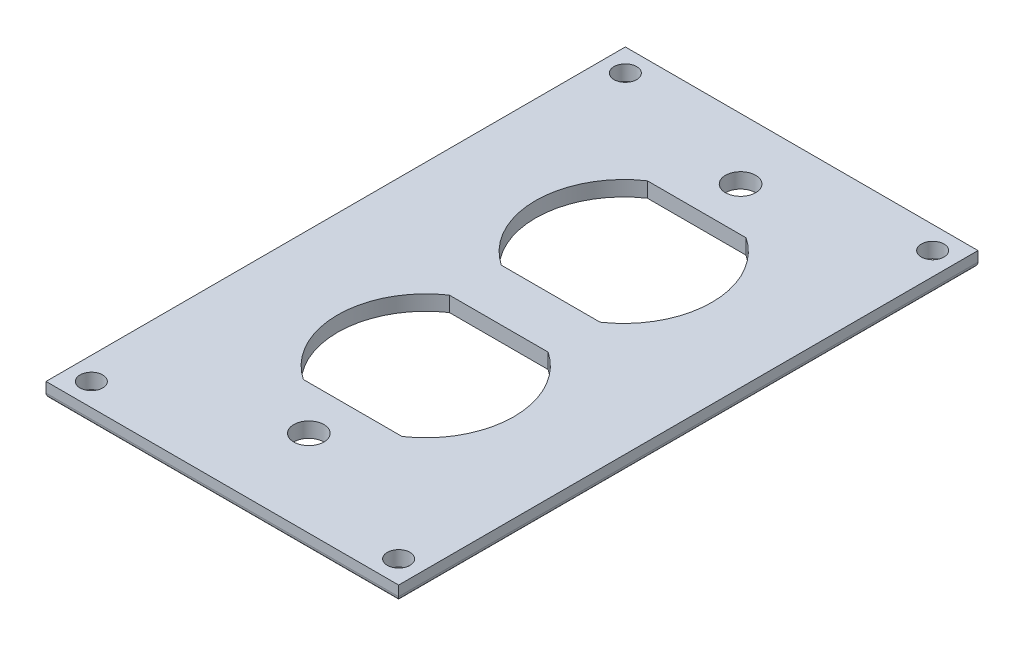
ISO-10303-21;
HEADER;
FILE_DESCRIPTION(('STEP AP214'),'2;1');
FILE_NAME('part.step','',(''),(''),'','','');
FILE_SCHEMA(('AUTOMOTIVE_DESIGN { 1 0 10303 214 1 1 1 1 }'));
ENDSEC;
DATA;
#1=APPLICATION_CONTEXT('core data for automotive mechanical design processes');
#2=APPLICATION_PROTOCOL_DEFINITION('international standard','automotive_design',2000,#1);
#3=PRODUCT_CONTEXT('',#1,'mechanical');
#4=PRODUCT('Part','Part','',(#3));
#5=PRODUCT_RELATED_PRODUCT_CATEGORY('part','',(#4));
#6=PRODUCT_DEFINITION_FORMATION('','',#4);
#7=PRODUCT_DEFINITION_CONTEXT('part definition',#1,'design');
#8=PRODUCT_DEFINITION('design','',#6,#7);
#9=PRODUCT_DEFINITION_SHAPE('','',#8);
#10=(LENGTH_UNIT() NAMED_UNIT(*) SI_UNIT(.MILLI.,.METRE.));
#11=(NAMED_UNIT(*) PLANE_ANGLE_UNIT() SI_UNIT($,.RADIAN.));
#12=(NAMED_UNIT(*) SI_UNIT($,.STERADIAN.) SOLID_ANGLE_UNIT());
#13=UNCERTAINTY_MEASURE_WITH_UNIT(LENGTH_MEASURE(1.E-05),#10,'distance_accuracy_value','');
#14=(GEOMETRIC_REPRESENTATION_CONTEXT(3) GLOBAL_UNCERTAINTY_ASSIGNED_CONTEXT((#13)) GLOBAL_UNIT_ASSIGNED_CONTEXT((#10,
#11,#12)) REPRESENTATION_CONTEXT('',''));
#15=CARTESIAN_POINT('',(0.,0.,0.));
#16=DIRECTION('',(0.,0.,1.));
#17=DIRECTION('',(1.,0.,0.));
#18=AXIS2_PLACEMENT_3D('',#15,#16,#17);
#19=CARTESIAN_POINT('',(0.,3.,0.));
#20=DIRECTION('',(0.,1.,0.));
#21=DIRECTION('',(0.,0.,1.));
#22=AXIS2_PLACEMENT_3D('',#19,#20,#21);
#23=PLANE('',#22);
#24=CARTESIAN_POINT('',(0.,3.,-45.375));
#25=DIRECTION('',(0.,1.,0.));
#26=DIRECTION('',(0.,0.,1.));
#27=AXIS2_PLACEMENT_3D('',#24,#25,#26);
#28=CIRCLE('',#27,3.);
#29=CARTESIAN_POINT('',(0.,3.,-42.375));
#30=VERTEX_POINT('',#29);
#31=EDGE_CURVE('E284',#30,#30,#28,.T.);
#32=ORIENTED_EDGE('',*,*,#31,.F.);
#33=EDGE_LOOP('',(#32));
#34=FACE_BOUND('',#33,.T.);
#35=CARTESIAN_POINT('',(0.,3.,40.325));
#36=DIRECTION('',(0.,1.,0.));
#37=DIRECTION('',(0.,0.,1.));
#38=AXIS2_PLACEMENT_3D('',#35,#36,#37);
#39=CIRCLE('',#38,3.);
#40=CARTESIAN_POINT('',(0.,3.,43.325));
#41=VERTEX_POINT('',#40);
#42=EDGE_CURVE('E281',#41,#41,#39,.T.);
#43=ORIENTED_EDGE('',*,*,#42,.F.);
#44=EDGE_LOOP('',(#43));
#45=FACE_BOUND('',#44,.T.);
#46=CARTESIAN_POINT('',(0.,3.,17.125));
#47=DIRECTION('',(0.,-1.,0.));
#48=DIRECTION('',(0.,0.,-1.));
#49=AXIS2_PLACEMENT_3D('',#46,#47,#48);
#50=CIRCLE('',#49,17.5);
#51=CARTESIAN_POINT('',(9.79795897113272,3.,2.62500000000001));
#52=VERTEX_POINT('',#51);
#53=CARTESIAN_POINT('',(9.7979589711327,3.,31.625));
#54=VERTEX_POINT('',#53);
#55=EDGE_CURVE('E251',#52,#54,#50,.T.);
#56=ORIENTED_EDGE('',*,*,#55,.T.);
#57=DIRECTION('',(1.,0.,0.));
#58=VECTOR('',#57,1.);
#59=CARTESIAN_POINT('',(0.,3.,31.625));
#60=LINE('',#59,#58);
#61=CARTESIAN_POINT('',(-9.79795897113269,3.,31.625));
#62=VERTEX_POINT('',#61);
#63=EDGE_CURVE('E161',#62,#54,#60,.T.);
#64=ORIENTED_EDGE('',*,*,#63,.F.);
#65=CARTESIAN_POINT('',(0.,3.,17.125));
#66=DIRECTION('',(0.,-1.,0.));
#67=DIRECTION('',(0.,0.,-1.));
#68=AXIS2_PLACEMENT_3D('',#65,#66,#67);
#69=CIRCLE('',#68,17.5);
#70=CARTESIAN_POINT('',(-9.79795897113271,3.,2.625));
#71=VERTEX_POINT('',#70);
#72=EDGE_CURVE('E256',#62,#71,#69,.T.);
#73=ORIENTED_EDGE('',*,*,#72,.T.);
#74=DIRECTION('',(1.,0.,0.));
#75=VECTOR('',#74,1.);
#76=CARTESIAN_POINT('',(0.,3.,2.62500000000001));
#77=LINE('',#76,#75);
#78=EDGE_CURVE('E253',#71,#52,#77,.T.);
#79=ORIENTED_EDGE('',*,*,#78,.T.);
#80=EDGE_LOOP('',(#56,#64,#73,#79));
#81=FACE_BOUND('',#80,.T.);
#82=DIRECTION('',(0.,0.,-1.));
#83=VECTOR('',#82,1.);
#84=CARTESIAN_POINT('',(35.,3.,-57.5));
#85=LINE('',#84,#83);
#86=CARTESIAN_POINT('',(35.,3.,57.5));
#87=VERTEX_POINT('',#86);
#88=CARTESIAN_POINT('',(35.,3.,-57.5));
#89=VERTEX_POINT('',#88);
#90=EDGE_CURVE('E220',#87,#89,#85,.T.);
#91=ORIENTED_EDGE('',*,*,#90,.T.);
#92=DIRECTION('',(-1.,0.,0.));
#93=VECTOR('',#92,1.);
#94=CARTESIAN_POINT('',(-35.,3.,-57.5));
#95=LINE('',#94,#93);
#96=CARTESIAN_POINT('',(-35.,3.,-57.5));
#97=VERTEX_POINT('',#96);
#98=EDGE_CURVE('E218',#89,#97,#95,.T.);
#99=ORIENTED_EDGE('',*,*,#98,.T.);
#100=DIRECTION('',(0.,0.,1.));
#101=VECTOR('',#100,1.);
#102=CARTESIAN_POINT('',(-35.,3.,-57.5));
#103=LINE('',#102,#101);
#104=CARTESIAN_POINT('',(-35.,3.,57.5));
#105=VERTEX_POINT('',#104);
#106=EDGE_CURVE('E216',#97,#105,#103,.T.);
#107=ORIENTED_EDGE('',*,*,#106,.T.);
#108=DIRECTION('',(1.,0.,0.));
#109=VECTOR('',#108,1.);
#110=CARTESIAN_POINT('',(-35.,3.,57.5));
#111=LINE('',#110,#109);
#112=EDGE_CURVE('E214',#105,#87,#111,.T.);
#113=ORIENTED_EDGE('',*,*,#112,.T.);
#114=EDGE_LOOP('',(#91,#99,#107,#113));
#115=FACE_BOUND('',#114,.T.);
#116=CARTESIAN_POINT('',(-30.5,3.,53.));
#117=DIRECTION('',(0.,-1.,0.));
#118=DIRECTION('',(0.,0.,-1.));
#119=AXIS2_PLACEMENT_3D('',#116,#117,#118);
#120=CIRCLE('',#119,2.25000000000001);
#121=CARTESIAN_POINT('',(-30.5,3.,50.75));
#122=VERTEX_POINT('',#121);
#123=EDGE_CURVE('E223',#122,#122,#120,.T.);
#124=ORIENTED_EDGE('',*,*,#123,.T.);
#125=EDGE_LOOP('',(#124));
#126=FACE_BOUND('',#125,.T.);
#127=CARTESIAN_POINT('',(-30.5,3.,-53.));
#128=DIRECTION('',(0.,1.,0.));
#129=DIRECTION('',(0.,0.,1.));
#130=AXIS2_PLACEMENT_3D('',#127,#128,#129);
#131=CIRCLE('',#130,2.25000000000001);
#132=CARTESIAN_POINT('',(-30.5,3.,-50.75));
#133=VERTEX_POINT('',#132);
#134=EDGE_CURVE('E227',#133,#133,#131,.T.);
#135=ORIENTED_EDGE('',*,*,#134,.F.);
#136=EDGE_LOOP('',(#135));
#137=FACE_BOUND('',#136,.T.);
#138=CARTESIAN_POINT('',(30.5,3.,53.));
#139=DIRECTION('',(0.,1.,0.));
#140=DIRECTION('',(0.,0.,-1.));
#141=AXIS2_PLACEMENT_3D('',#138,#139,#140);
#142=CIRCLE('',#141,2.25000000000001);
#143=CARTESIAN_POINT('',(30.5,3.,50.75));
#144=VERTEX_POINT('',#143);
#145=EDGE_CURVE('E233',#144,#144,#142,.T.);
#146=ORIENTED_EDGE('',*,*,#145,.F.);
#147=EDGE_LOOP('',(#146));
#148=FACE_BOUND('',#147,.T.);
#149=CARTESIAN_POINT('',(30.5,3.,-53.));
#150=DIRECTION('',(0.,-1.,0.));
#151=DIRECTION('',(0.,0.,1.));
#152=AXIS2_PLACEMENT_3D('',#149,#150,#151);
#153=CIRCLE('',#152,2.25000000000001);
#154=CARTESIAN_POINT('',(30.5,3.,-50.75));
#155=VERTEX_POINT('',#154);
#156=EDGE_CURVE('E239',#155,#155,#153,.T.);
#157=ORIENTED_EDGE('',*,*,#156,.T.);
#158=EDGE_LOOP('',(#157));
#159=FACE_BOUND('',#158,.T.);
#160=DIRECTION('',(1.,0.,0.));
#161=VECTOR('',#160,1.);
#162=CARTESIAN_POINT('',(0.,3.,-36.675));
#163=LINE('',#162,#161);
#164=CARTESIAN_POINT('',(-9.79795897113269,3.,-36.675));
#165=VERTEX_POINT('',#164);
#166=CARTESIAN_POINT('',(9.7979589711327,3.,-36.675));
#167=VERTEX_POINT('',#166);
#168=EDGE_CURVE('E274',#165,#167,#163,.T.);
#169=ORIENTED_EDGE('',*,*,#168,.T.);
#170=CARTESIAN_POINT('',(0.,3.,-22.175));
#171=DIRECTION('',(0.,1.,0.));
#172=DIRECTION('',(0.,0.,1.));
#173=AXIS2_PLACEMENT_3D('',#170,#171,#172);
#174=CIRCLE('',#173,17.5);
#175=CARTESIAN_POINT('',(9.79795897113272,3.,-7.67499999999999));
#176=VERTEX_POINT('',#175);
#177=EDGE_CURVE('E272',#176,#167,#174,.T.);
#178=ORIENTED_EDGE('',*,*,#177,.F.);
#179=DIRECTION('',(1.,0.,0.));
#180=VECTOR('',#179,1.);
#181=CARTESIAN_POINT('',(0.,3.,-7.67499999999999));
#182=LINE('',#181,#180);
#183=CARTESIAN_POINT('',(-9.79795897113271,3.,-7.67499999999999));
#184=VERTEX_POINT('',#183);
#185=EDGE_CURVE('E270',#184,#176,#182,.T.);
#186=ORIENTED_EDGE('',*,*,#185,.F.);
#187=CARTESIAN_POINT('',(0.,3.,-22.175));
#188=DIRECTION('',(0.,1.,0.));
#189=DIRECTION('',(0.,0.,1.));
#190=AXIS2_PLACEMENT_3D('',#187,#188,#189);
#191=CIRCLE('',#190,17.5);
#192=EDGE_CURVE('E266',#165,#184,#191,.T.);
#193=ORIENTED_EDGE('',*,*,#192,.F.);
#194=EDGE_LOOP('',(#169,#178,#186,#193));
#195=FACE_BOUND('',#194,.T.);
#196=ADVANCED_FACE('F39',(#34,#45,#81,#115,#126,#137,#148,#159,#195),#23,.T.);
#197=CARTESIAN_POINT('',(0.,0.,0.));
#198=DIRECTION('',(0.,1.,0.));
#199=DIRECTION('',(0.,0.,1.));
#200=AXIS2_PLACEMENT_3D('',#197,#198,#199);
#201=PLANE('',#200);
#202=CARTESIAN_POINT('',(0.,0.,-45.375));
#203=DIRECTION('',(0.,1.,0.));
#204=DIRECTION('',(0.,0.,1.));
#205=AXIS2_PLACEMENT_3D('',#202,#203,#204);
#206=CIRCLE('',#205,3.);
#207=CARTESIAN_POINT('',(0.,0.,-42.375));
#208=VERTEX_POINT('',#207);
#209=EDGE_CURVE('E277',#208,#208,#206,.T.);
#210=ORIENTED_EDGE('',*,*,#209,.T.);
#211=EDGE_LOOP('',(#210));
#212=FACE_BOUND('',#211,.T.);
#213=CARTESIAN_POINT('',(0.,0.,40.325));
#214=DIRECTION('',(0.,1.,0.));
#215=DIRECTION('',(0.,0.,1.));
#216=AXIS2_PLACEMENT_3D('',#213,#214,#215);
#217=CIRCLE('',#216,3.);
#218=CARTESIAN_POINT('',(0.,0.,43.325));
#219=VERTEX_POINT('',#218);
#220=EDGE_CURVE('E278',#219,#219,#217,.T.);
#221=ORIENTED_EDGE('',*,*,#220,.T.);
#222=EDGE_LOOP('',(#221));
#223=FACE_BOUND('',#222,.T.);
#224=CARTESIAN_POINT('',(-30.5,0.,53.));
#225=DIRECTION('',(0.,-1.,0.));
#226=DIRECTION('',(0.,0.,-1.));
#227=AXIS2_PLACEMENT_3D('',#224,#225,#226);
#228=CIRCLE('',#227,2.25000000000001);
#229=CARTESIAN_POINT('',(-30.5,0.,50.75));
#230=VERTEX_POINT('',#229);
#231=EDGE_CURVE('E224',#230,#230,#228,.T.);
#232=ORIENTED_EDGE('',*,*,#231,.F.);
#233=EDGE_LOOP('',(#232));
#234=FACE_BOUND('',#233,.T.);
#235=CARTESIAN_POINT('',(-30.5,0.,-53.));
#236=DIRECTION('',(0.,1.,0.));
#237=DIRECTION('',(0.,0.,1.));
#238=AXIS2_PLACEMENT_3D('',#235,#236,#237);
#239=CIRCLE('',#238,2.25000000000001);
#240=CARTESIAN_POINT('',(-30.5,0.,-50.75));
#241=VERTEX_POINT('',#240);
#242=EDGE_CURVE('E230',#241,#241,#239,.T.);
#243=ORIENTED_EDGE('',*,*,#242,.T.);
#244=EDGE_LOOP('',(#243));
#245=FACE_BOUND('',#244,.T.);
#246=CARTESIAN_POINT('',(30.5,0.,53.));
#247=DIRECTION('',(0.,1.,0.));
#248=DIRECTION('',(0.,0.,-1.));
#249=AXIS2_PLACEMENT_3D('',#246,#247,#248);
#250=CIRCLE('',#249,2.25000000000001);
#251=CARTESIAN_POINT('',(30.5,0.,50.75));
#252=VERTEX_POINT('',#251);
#253=EDGE_CURVE('E236',#252,#252,#250,.T.);
#254=ORIENTED_EDGE('',*,*,#253,.T.);
#255=EDGE_LOOP('',(#254));
#256=FACE_BOUND('',#255,.T.);
#257=CARTESIAN_POINT('',(30.5,0.,-53.));
#258=DIRECTION('',(0.,-1.,0.));
#259=DIRECTION('',(0.,0.,1.));
#260=AXIS2_PLACEMENT_3D('',#257,#258,#259);
#261=CIRCLE('',#260,2.25000000000001);
#262=CARTESIAN_POINT('',(30.5,0.,-50.75));
#263=VERTEX_POINT('',#262);
#264=EDGE_CURVE('E178',#263,#263,#261,.T.);
#265=ORIENTED_EDGE('',*,*,#264,.F.);
#266=EDGE_LOOP('',(#265));
#267=FACE_BOUND('',#266,.T.);
#268=DIRECTION('',(0.,0.,-1.));
#269=VECTOR('',#268,1.);
#270=CARTESIAN_POINT('',(34.,0.,0.));
#271=LINE('',#270,#269);
#272=CARTESIAN_POINT('',(34.,0.,-56.5));
#273=VERTEX_POINT('',#272);
#274=CARTESIAN_POINT('',(34.,0.,56.5));
#275=VERTEX_POINT('',#274);
#276=EDGE_CURVE('E197',#273,#275,#271,.F.);
#277=ORIENTED_EDGE('',*,*,#276,.T.);
#278=DIRECTION('',(1.,0.,0.));
#279=VECTOR('',#278,1.);
#280=CARTESIAN_POINT('',(0.,0.,56.5));
#281=LINE('',#280,#279);
#282=CARTESIAN_POINT('',(-34.,0.,56.5));
#283=VERTEX_POINT('',#282);
#284=EDGE_CURVE('E190',#275,#283,#281,.F.);
#285=ORIENTED_EDGE('',*,*,#284,.T.);
#286=DIRECTION('',(0.,0.,1.));
#287=VECTOR('',#286,1.);
#288=CARTESIAN_POINT('',(-34.,0.,0.));
#289=LINE('',#288,#287);
#290=CARTESIAN_POINT('',(-34.,0.,-56.5));
#291=VERTEX_POINT('',#290);
#292=EDGE_CURVE('E193',#283,#291,#289,.F.);
#293=ORIENTED_EDGE('',*,*,#292,.T.);
#294=DIRECTION('',(-1.,0.,0.));
#295=VECTOR('',#294,1.);
#296=CARTESIAN_POINT('',(0.,0.,-56.5));
#297=LINE('',#296,#295);
#298=EDGE_CURVE('E195',#291,#273,#297,.F.);
#299=ORIENTED_EDGE('',*,*,#298,.T.);
#300=EDGE_LOOP('',(#277,#285,#293,#299));
#301=FACE_BOUND('',#300,.T.);
#302=DIRECTION('',(-1.,0.,0.));
#303=VECTOR('',#302,1.);
#304=CARTESIAN_POINT('',(0.,0.,31.625));
#305=LINE('',#304,#303);
#306=CARTESIAN_POINT('',(9.7979589711327,0.,31.625));
#307=VERTEX_POINT('',#306);
#308=CARTESIAN_POINT('',(-9.79795897113269,0.,31.625));
#309=VERTEX_POINT('',#308);
#310=EDGE_CURVE('E155',#307,#309,#305,.T.);
#311=ORIENTED_EDGE('',*,*,#310,.F.);
#312=CARTESIAN_POINT('',(0.,0.,17.125));
#313=DIRECTION('',(0.,-1.,0.));
#314=DIRECTION('',(0.,0.,-1.));
#315=AXIS2_PLACEMENT_3D('',#312,#313,#314);
#316=CIRCLE('',#315,17.5);
#317=CARTESIAN_POINT('',(9.79795897113273,0.,2.62500000000001));
#318=VERTEX_POINT('',#317);
#319=EDGE_CURVE('E145',#307,#318,#316,.F.);
#320=ORIENTED_EDGE('',*,*,#319,.T.);
#321=DIRECTION('',(1.,0.,0.));
#322=VECTOR('',#321,1.);
#323=CARTESIAN_POINT('',(0.,0.,2.62500000000001));
#324=LINE('',#323,#322);
#325=CARTESIAN_POINT('',(-9.79795897113272,0.,2.62500000000001));
#326=VERTEX_POINT('',#325);
#327=EDGE_CURVE('E156',#318,#326,#324,.F.);
#328=ORIENTED_EDGE('',*,*,#327,.T.);
#329=CARTESIAN_POINT('',(0.,0.,17.125));
#330=DIRECTION('',(0.,-1.,0.));
#331=DIRECTION('',(0.,0.,-1.));
#332=AXIS2_PLACEMENT_3D('',#329,#330,#331);
#333=CIRCLE('',#332,17.5);
#334=EDGE_CURVE('E166',#326,#309,#333,.F.);
#335=ORIENTED_EDGE('',*,*,#334,.T.);
#336=EDGE_LOOP('',(#311,#320,#328,#335));
#337=FACE_BOUND('',#336,.T.);
#338=CARTESIAN_POINT('',(0.,0.,-22.175));
#339=DIRECTION('',(0.,-1.,0.));
#340=DIRECTION('',(0.,0.,-1.));
#341=AXIS2_PLACEMENT_3D('',#338,#339,#340);
#342=CIRCLE('',#341,17.5);
#343=CARTESIAN_POINT('',(9.7979589711327,0.,-36.675));
#344=VERTEX_POINT('',#343);
#345=CARTESIAN_POINT('',(9.79795897113273,0.,-7.675));
#346=VERTEX_POINT('',#345);
#347=EDGE_CURVE('E167',#344,#346,#342,.T.);
#348=ORIENTED_EDGE('',*,*,#347,.F.);
#349=DIRECTION('',(1.,0.,0.));
#350=VECTOR('',#349,1.);
#351=CARTESIAN_POINT('',(0.,0.,-36.675));
#352=LINE('',#351,#350);
#353=CARTESIAN_POINT('',(-9.79795897113269,0.,-36.675));
#354=VERTEX_POINT('',#353);
#355=EDGE_CURVE('E11',#344,#354,#352,.F.);
#356=ORIENTED_EDGE('',*,*,#355,.T.);
#357=CARTESIAN_POINT('',(0.,0.,-22.175));
#358=DIRECTION('',(0.,-1.,0.));
#359=DIRECTION('',(0.,0.,-1.));
#360=AXIS2_PLACEMENT_3D('',#357,#358,#359);
#361=CIRCLE('',#360,17.5);
#362=CARTESIAN_POINT('',(-9.79795897113271,0.,-7.67499999999999));
#363=VERTEX_POINT('',#362);
#364=EDGE_CURVE('E48',#363,#354,#361,.T.);
#365=ORIENTED_EDGE('',*,*,#364,.F.);
#366=DIRECTION('',(-1.,0.,0.));
#367=VECTOR('',#366,1.);
#368=CARTESIAN_POINT('',(0.,0.,-7.67499999999999));
#369=LINE('',#368,#367);
#370=EDGE_CURVE('E72',#346,#363,#369,.T.);
#371=ORIENTED_EDGE('',*,*,#370,.F.);
#372=EDGE_LOOP('',(#348,#356,#365,#371));
#373=FACE_BOUND('',#372,.T.);
#374=ADVANCED_FACE('F164',(#212,#223,#234,#245,#256,#267,#301,#337,#373),#201,.F.);
#375=CARTESIAN_POINT('',(35.,3.,-57.5));
#376=DIRECTION('',(-1.,0.,0.));
#377=DIRECTION('',(0.,0.,1.));
#378=AXIS2_PLACEMENT_3D('',#375,#376,#377);
#379=PLANE('',#378);
#380=DIRECTION('',(0.,-1.,0.));
#381=VECTOR('',#380,1.);
#382=CARTESIAN_POINT('',(35.,3.,57.5));
#383=LINE('',#382,#381);
#384=CARTESIAN_POINT('',(35.,1.,57.5));
#385=VERTEX_POINT('',#384);
#386=EDGE_CURVE('E211',#87,#385,#383,.T.);
#387=ORIENTED_EDGE('',*,*,#386,.T.);
#388=DIRECTION('',(0.,0.,-1.));
#389=VECTOR('',#388,1.);
#390=CARTESIAN_POINT('',(35.,1.,-57.5));
#391=LINE('',#390,#389);
#392=CARTESIAN_POINT('',(35.,1.,-57.5));
#393=VERTEX_POINT('',#392);
#394=EDGE_CURVE('E174',#385,#393,#391,.T.);
#395=ORIENTED_EDGE('',*,*,#394,.T.);
#396=DIRECTION('',(0.,-1.,0.));
#397=VECTOR('',#396,1.);
#398=CARTESIAN_POINT('',(35.,3.,-57.5));
#399=LINE('',#398,#397);
#400=EDGE_CURVE('E202',#89,#393,#399,.T.);
#401=ORIENTED_EDGE('',*,*,#400,.F.);
#402=ORIENTED_EDGE('',*,*,#90,.F.);
#403=EDGE_LOOP('',(#387,#395,#401,#402));
#404=FACE_BOUND('',#403,.T.);
#405=ADVANCED_FACE('F376',(#404),#379,.F.);
#406=CARTESIAN_POINT('',(-35.,3.,-57.5));
#407=DIRECTION('',(0.,0.,1.));
#408=DIRECTION('',(1.,0.,0.));
#409=AXIS2_PLACEMENT_3D('',#406,#407,#408);
#410=PLANE('',#409);
#411=ORIENTED_EDGE('',*,*,#400,.T.);
#412=DIRECTION('',(-1.,0.,0.));
#413=VECTOR('',#412,1.);
#414=CARTESIAN_POINT('',(-35.,1.,-57.5));
#415=LINE('',#414,#413);
#416=CARTESIAN_POINT('',(-35.,1.,-57.5));
#417=VERTEX_POINT('',#416);
#418=EDGE_CURVE('E186',#393,#417,#415,.T.);
#419=ORIENTED_EDGE('',*,*,#418,.T.);
#420=DIRECTION('',(0.,-1.,0.));
#421=VECTOR('',#420,1.);
#422=CARTESIAN_POINT('',(-35.,3.,-57.5));
#423=LINE('',#422,#421);
#424=EDGE_CURVE('E205',#97,#417,#423,.T.);
#425=ORIENTED_EDGE('',*,*,#424,.F.);
#426=ORIENTED_EDGE('',*,*,#98,.F.);
#427=EDGE_LOOP('',(#411,#419,#425,#426));
#428=FACE_BOUND('',#427,.T.);
#429=ADVANCED_FACE('F383',(#428),#410,.F.);
#430=CARTESIAN_POINT('',(-35.,3.,-57.5));
#431=DIRECTION('',(1.,0.,0.));
#432=DIRECTION('',(0.,0.,-1.));
#433=AXIS2_PLACEMENT_3D('',#430,#431,#432);
#434=PLANE('',#433);
#435=ORIENTED_EDGE('',*,*,#424,.T.);
#436=DIRECTION('',(0.,0.,1.));
#437=VECTOR('',#436,1.);
#438=CARTESIAN_POINT('',(-35.,1.,-57.5));
#439=LINE('',#438,#437);
#440=CARTESIAN_POINT('',(-35.,1.,57.5));
#441=VERTEX_POINT('',#440);
#442=EDGE_CURVE('E188',#417,#441,#439,.T.);
#443=ORIENTED_EDGE('',*,*,#442,.T.);
#444=DIRECTION('',(0.,-1.,0.));
#445=VECTOR('',#444,1.);
#446=CARTESIAN_POINT('',(-35.,3.,57.5));
#447=LINE('',#446,#445);
#448=EDGE_CURVE('E208',#105,#441,#447,.T.);
#449=ORIENTED_EDGE('',*,*,#448,.F.);
#450=ORIENTED_EDGE('',*,*,#106,.F.);
#451=EDGE_LOOP('',(#435,#443,#449,#450));
#452=FACE_BOUND('',#451,.T.);
#453=ADVANCED_FACE('F379',(#452),#434,.F.);
#454=CARTESIAN_POINT('',(-35.,3.,57.5));
#455=DIRECTION('',(0.,0.,-1.));
#456=DIRECTION('',(-1.,0.,0.));
#457=AXIS2_PLACEMENT_3D('',#454,#455,#456);
#458=PLANE('',#457);
#459=ORIENTED_EDGE('',*,*,#448,.T.);
#460=DIRECTION('',(1.,0.,0.));
#461=VECTOR('',#460,1.);
#462=CARTESIAN_POINT('',(-35.,1.,57.5));
#463=LINE('',#462,#461);
#464=EDGE_CURVE('E199',#441,#385,#463,.T.);
#465=ORIENTED_EDGE('',*,*,#464,.T.);
#466=ORIENTED_EDGE('',*,*,#386,.F.);
#467=ORIENTED_EDGE('',*,*,#112,.F.);
#468=EDGE_LOOP('',(#459,#465,#466,#467));
#469=FACE_BOUND('',#468,.T.);
#470=ADVANCED_FACE('F371',(#469),#458,.F.);
#471=CARTESIAN_POINT('',(-30.5,3.,53.));
#472=DIRECTION('',(0.,-1.,0.));
#473=DIRECTION('',(0.,0.,-1.));
#474=AXIS2_PLACEMENT_3D('',#471,#472,#473);
#475=CYLINDRICAL_SURFACE('',#474,2.25000000000001);
#476=ORIENTED_EDGE('',*,*,#123,.F.);
#477=EDGE_LOOP('',(#476));
#478=FACE_BOUND('',#477,.T.);
#479=ORIENTED_EDGE('',*,*,#231,.T.);
#480=EDGE_LOOP('',(#479));
#481=FACE_BOUND('',#480,.T.);
#482=ADVANCED_FACE('F368',(#478,#481),#475,.F.);
#483=CARTESIAN_POINT('',(-30.5,3.,-53.));
#484=DIRECTION('',(0.,-1.,0.));
#485=DIRECTION('',(0.,0.,-1.));
#486=AXIS2_PLACEMENT_3D('',#483,#484,#485);
#487=CYLINDRICAL_SURFACE('',#486,2.25000000000001);
#488=ORIENTED_EDGE('',*,*,#134,.T.);
#489=EDGE_LOOP('',(#488));
#490=FACE_BOUND('',#489,.T.);
#491=ORIENTED_EDGE('',*,*,#242,.F.);
#492=EDGE_LOOP('',(#491));
#493=FACE_BOUND('',#492,.T.);
#494=ADVANCED_FACE('F364',(#490,#493),#487,.F.);
#495=CARTESIAN_POINT('',(30.5,3.,53.));
#496=DIRECTION('',(0.,-1.,0.));
#497=DIRECTION('',(0.,0.,-1.));
#498=AXIS2_PLACEMENT_3D('',#495,#496,#497);
#499=CYLINDRICAL_SURFACE('',#498,2.25000000000001);
#500=ORIENTED_EDGE('',*,*,#145,.T.);
#501=EDGE_LOOP('',(#500));
#502=FACE_BOUND('',#501,.T.);
#503=ORIENTED_EDGE('',*,*,#253,.F.);
#504=EDGE_LOOP('',(#503));
#505=FACE_BOUND('',#504,.T.);
#506=ADVANCED_FACE('F360',(#502,#505),#499,.F.);
#507=CARTESIAN_POINT('',(30.5,3.,-53.));
#508=DIRECTION('',(0.,-1.,0.));
#509=DIRECTION('',(0.,0.,-1.));
#510=AXIS2_PLACEMENT_3D('',#507,#508,#509);
#511=CYLINDRICAL_SURFACE('',#510,2.25000000000001);
#512=ORIENTED_EDGE('',*,*,#156,.F.);
#513=EDGE_LOOP('',(#512));
#514=FACE_BOUND('',#513,.T.);
#515=ORIENTED_EDGE('',*,*,#264,.T.);
#516=EDGE_LOOP('',(#515));
#517=FACE_BOUND('',#516,.T.);
#518=ADVANCED_FACE('F357',(#514,#517),#511,.F.);
#519=CARTESIAN_POINT('',(-35.,1.,-56.5));
#520=DIRECTION('',(-1.,0.,0.));
#521=DIRECTION('',(0.,0.,1.));
#522=AXIS2_PLACEMENT_3D('',#519,#520,#521);
#523=CYLINDRICAL_SURFACE('',#522,1.);
#524=CARTESIAN_POINT('',(34.,1.,-56.5));
#525=DIRECTION('',(-0.707106781186547,0.,-0.707106781186547));
#526=DIRECTION('',(0.707106781186547,0.,-0.707106781186548));
#527=AXIS2_PLACEMENT_3D('',#524,#525,#526);
#528=ELLIPSE('',#527,1.41421356237309,1.);
#529=EDGE_CURVE('E179',#273,#393,#528,.F.);
#530=ORIENTED_EDGE('',*,*,#529,.F.);
#531=ORIENTED_EDGE('',*,*,#298,.F.);
#532=CARTESIAN_POINT('',(-34.,1.,-56.5));
#533=DIRECTION('',(-0.707106781186547,0.,0.707106781186548));
#534=DIRECTION('',(-0.707106781186548,0.,-0.707106781186547));
#535=AXIS2_PLACEMENT_3D('',#532,#533,#534);
#536=ELLIPSE('',#535,1.4142135623731,1.);
#537=EDGE_CURVE('E175',#417,#291,#536,.T.);
#538=ORIENTED_EDGE('',*,*,#537,.F.);
#539=ORIENTED_EDGE('',*,*,#418,.F.);
#540=EDGE_LOOP('',(#530,#531,#538,#539));
#541=FACE_BOUND('',#540,.T.);
#542=ADVANCED_FACE('F41',(#541),#523,.T.);
#543=CARTESIAN_POINT('',(-34.,1.,-57.5));
#544=DIRECTION('',(0.,0.,1.));
#545=DIRECTION('',(1.,0.,0.));
#546=AXIS2_PLACEMENT_3D('',#543,#544,#545);
#547=CYLINDRICAL_SURFACE('',#546,1.);
#548=ORIENTED_EDGE('',*,*,#537,.T.);
#549=ORIENTED_EDGE('',*,*,#292,.F.);
#550=CARTESIAN_POINT('',(-34.,1.,56.5));
#551=DIRECTION('',(0.707106781186548,0.,0.707106781186547));
#552=DIRECTION('',(-0.707106781186547,0.,0.707106781186548));
#553=AXIS2_PLACEMENT_3D('',#550,#551,#552);
#554=ELLIPSE('',#553,1.41421356237309,1.);
#555=EDGE_CURVE('E182',#441,#283,#554,.T.);
#556=ORIENTED_EDGE('',*,*,#555,.F.);
#557=ORIENTED_EDGE('',*,*,#442,.F.);
#558=EDGE_LOOP('',(#548,#549,#556,#557));
#559=FACE_BOUND('',#558,.T.);
#560=ADVANCED_FACE('F396',(#559),#547,.T.);
#561=CARTESIAN_POINT('',(34.,1.,-57.5));
#562=DIRECTION('',(0.,0.,-1.));
#563=DIRECTION('',(-1.,0.,0.));
#564=AXIS2_PLACEMENT_3D('',#561,#562,#563);
#565=CYLINDRICAL_SURFACE('',#564,1.);
#566=ORIENTED_EDGE('',*,*,#529,.T.);
#567=ORIENTED_EDGE('',*,*,#394,.F.);
#568=CARTESIAN_POINT('',(34.,1.,56.5));
#569=DIRECTION('',(0.707106781186547,0.,-0.707106781186548));
#570=DIRECTION('',(-0.707106781186547,0.,-0.707106781186547));
#571=AXIS2_PLACEMENT_3D('',#568,#569,#570);
#572=ELLIPSE('',#571,1.4142135623731,1.);
#573=EDGE_CURVE('E162',#275,#385,#572,.F.);
#574=ORIENTED_EDGE('',*,*,#573,.F.);
#575=ORIENTED_EDGE('',*,*,#276,.F.);
#576=EDGE_LOOP('',(#566,#567,#574,#575));
#577=FACE_BOUND('',#576,.T.);
#578=ADVANCED_FACE('F393',(#577),#565,.T.);
#579=CARTESIAN_POINT('',(-35.,1.,56.5));
#580=DIRECTION('',(1.,0.,0.));
#581=DIRECTION('',(0.,0.,-1.));
#582=AXIS2_PLACEMENT_3D('',#579,#580,#581);
#583=CYLINDRICAL_SURFACE('',#582,1.);
#584=ORIENTED_EDGE('',*,*,#555,.T.);
#585=ORIENTED_EDGE('',*,*,#284,.F.);
#586=ORIENTED_EDGE('',*,*,#573,.T.);
#587=ORIENTED_EDGE('',*,*,#464,.F.);
#588=EDGE_LOOP('',(#584,#585,#586,#587));
#589=FACE_BOUND('',#588,.T.);
#590=ADVANCED_FACE('F356',(#589),#583,.T.);
#591=CARTESIAN_POINT('',(0.,3.,31.625));
#592=DIRECTION('',(0.,0.,-1.));
#593=DIRECTION('',(-1.,0.,0.));
#594=AXIS2_PLACEMENT_3D('',#591,#592,#593);
#595=PLANE('',#594);
#596=ORIENTED_EDGE('',*,*,#310,.T.);
#597=DIRECTION('',(0.,-1.,0.));
#598=VECTOR('',#597,1.);
#599=CARTESIAN_POINT('',(-9.79795897113269,3.,31.625));
#600=LINE('',#599,#598);
#601=EDGE_CURVE('E87',#62,#309,#600,.T.);
#602=ORIENTED_EDGE('',*,*,#601,.F.);
#603=ORIENTED_EDGE('',*,*,#63,.T.);
#604=DIRECTION('',(0.,-1.,0.));
#605=VECTOR('',#604,1.);
#606=CARTESIAN_POINT('',(9.7979589711327,3.,31.625));
#607=LINE('',#606,#605);
#608=EDGE_CURVE('E149',#54,#307,#607,.T.);
#609=ORIENTED_EDGE('',*,*,#608,.T.);
#610=EDGE_LOOP('',(#596,#602,#603,#609));
#611=FACE_BOUND('',#610,.T.);
#612=ADVANCED_FACE('F158',(#611),#595,.T.);
#613=CARTESIAN_POINT('',(0.,3.,17.125));
#614=DIRECTION('',(0.,-1.,0.));
#615=DIRECTION('',(0.,0.,-1.));
#616=AXIS2_PLACEMENT_3D('',#613,#614,#615);
#617=CYLINDRICAL_SURFACE('',#616,17.5);
#618=ORIENTED_EDGE('',*,*,#608,.F.);
#619=ORIENTED_EDGE('',*,*,#55,.F.);
#620=DIRECTION('',(0.,-1.,0.));
#621=VECTOR('',#620,1.);
#622=CARTESIAN_POINT('',(9.79795897113272,3.,2.62500000000001));
#623=LINE('',#622,#621);
#624=EDGE_CURVE('E151',#52,#318,#623,.T.);
#625=ORIENTED_EDGE('',*,*,#624,.T.);
#626=ORIENTED_EDGE('',*,*,#319,.F.);
#627=EDGE_LOOP('',(#618,#619,#625,#626));
#628=FACE_BOUND('',#627,.T.);
#629=ADVANCED_FACE('F147',(#628),#617,.F.);
#630=CARTESIAN_POINT('',(0.,3.,2.62500000000001));
#631=DIRECTION('',(0.,0.,-1.));
#632=DIRECTION('',(-1.,0.,0.));
#633=AXIS2_PLACEMENT_3D('',#630,#631,#632);
#634=PLANE('',#633);
#635=ORIENTED_EDGE('',*,*,#624,.F.);
#636=ORIENTED_EDGE('',*,*,#78,.F.);
#637=DIRECTION('',(0.,-1.,0.));
#638=VECTOR('',#637,1.);
#639=CARTESIAN_POINT('',(-9.79795897113271,3.,2.625));
#640=LINE('',#639,#638);
#641=EDGE_CURVE('E247',#71,#326,#640,.T.);
#642=ORIENTED_EDGE('',*,*,#641,.T.);
#643=ORIENTED_EDGE('',*,*,#327,.F.);
#644=EDGE_LOOP('',(#635,#636,#642,#643));
#645=FACE_BOUND('',#644,.T.);
#646=ADVANCED_FACE('F347',(#645),#634,.F.);
#647=CARTESIAN_POINT('',(0.,3.,17.125));
#648=DIRECTION('',(0.,-1.,0.));
#649=DIRECTION('',(0.,0.,-1.));
#650=AXIS2_PLACEMENT_3D('',#647,#648,#649);
#651=CYLINDRICAL_SURFACE('',#650,17.5);
#652=ORIENTED_EDGE('',*,*,#641,.F.);
#653=ORIENTED_EDGE('',*,*,#72,.F.);
#654=ORIENTED_EDGE('',*,*,#601,.T.);
#655=ORIENTED_EDGE('',*,*,#334,.F.);
#656=EDGE_LOOP('',(#652,#653,#654,#655));
#657=FACE_BOUND('',#656,.T.);
#658=ADVANCED_FACE('F344',(#657),#651,.F.);
#659=CARTESIAN_POINT('',(0.,3.,-36.675));
#660=DIRECTION('',(0.,0.,-1.));
#661=DIRECTION('',(-1.,0.,0.));
#662=AXIS2_PLACEMENT_3D('',#659,#660,#661);
#663=PLANE('',#662);
#664=DIRECTION('',(0.,-1.,0.));
#665=VECTOR('',#664,1.);
#666=CARTESIAN_POINT('',(9.7979589711327,3.,-36.675));
#667=LINE('',#666,#665);
#668=EDGE_CURVE('E264',#167,#344,#667,.T.);
#669=ORIENTED_EDGE('',*,*,#668,.F.);
#670=ORIENTED_EDGE('',*,*,#168,.F.);
#671=DIRECTION('',(0.,-1.,0.));
#672=VECTOR('',#671,1.);
#673=CARTESIAN_POINT('',(-9.79795897113269,3.,-36.675));
#674=LINE('',#673,#672);
#675=EDGE_CURVE('E260',#165,#354,#674,.T.);
#676=ORIENTED_EDGE('',*,*,#675,.T.);
#677=ORIENTED_EDGE('',*,*,#355,.F.);
#678=EDGE_LOOP('',(#669,#670,#676,#677));
#679=FACE_BOUND('',#678,.T.);
#680=ADVANCED_FACE('F325',(#679),#663,.F.);
#681=CARTESIAN_POINT('',(0.,3.,-22.175));
#682=DIRECTION('',(0.,-1.,0.));
#683=DIRECTION('',(0.,0.,-1.));
#684=AXIS2_PLACEMENT_3D('',#681,#682,#683);
#685=CYLINDRICAL_SURFACE('',#684,17.5);
#686=ORIENTED_EDGE('',*,*,#364,.T.);
#687=ORIENTED_EDGE('',*,*,#675,.F.);
#688=ORIENTED_EDGE('',*,*,#192,.T.);
#689=DIRECTION('',(0.,-1.,0.));
#690=VECTOR('',#689,1.);
#691=CARTESIAN_POINT('',(-9.79795897113271,3.,-7.67499999999999));
#692=LINE('',#691,#690);
#693=EDGE_CURVE('E261',#184,#363,#692,.T.);
#694=ORIENTED_EDGE('',*,*,#693,.T.);
#695=EDGE_LOOP('',(#686,#687,#688,#694));
#696=FACE_BOUND('',#695,.T.);
#697=ADVANCED_FACE('F327',(#696),#685,.F.);
#698=CARTESIAN_POINT('',(0.,3.,-7.67499999999999));
#699=DIRECTION('',(0.,0.,-1.));
#700=DIRECTION('',(-1.,0.,0.));
#701=AXIS2_PLACEMENT_3D('',#698,#699,#700);
#702=PLANE('',#701);
#703=ORIENTED_EDGE('',*,*,#370,.T.);
#704=ORIENTED_EDGE('',*,*,#693,.F.);
#705=ORIENTED_EDGE('',*,*,#185,.T.);
#706=DIRECTION('',(0.,-1.,0.));
#707=VECTOR('',#706,1.);
#708=CARTESIAN_POINT('',(9.79795897113272,3.,-7.675));
#709=LINE('',#708,#707);
#710=EDGE_CURVE('E56',#176,#346,#709,.T.);
#711=ORIENTED_EDGE('',*,*,#710,.T.);
#712=EDGE_LOOP('',(#703,#704,#705,#711));
#713=FACE_BOUND('',#712,.T.);
#714=ADVANCED_FACE('F328',(#713),#702,.T.);
#715=CARTESIAN_POINT('',(0.,3.,-22.175));
#716=DIRECTION('',(0.,-1.,0.));
#717=DIRECTION('',(0.,0.,-1.));
#718=AXIS2_PLACEMENT_3D('',#715,#716,#717);
#719=CYLINDRICAL_SURFACE('',#718,17.5);
#720=ORIENTED_EDGE('',*,*,#347,.T.);
#721=ORIENTED_EDGE('',*,*,#710,.F.);
#722=ORIENTED_EDGE('',*,*,#177,.T.);
#723=ORIENTED_EDGE('',*,*,#668,.T.);
#724=EDGE_LOOP('',(#720,#721,#722,#723));
#725=FACE_BOUND('',#724,.T.);
#726=ADVANCED_FACE('F330',(#725),#719,.F.);
#727=CARTESIAN_POINT('',(0.,0.,40.325));
#728=DIRECTION('',(0.,1.,0.));
#729=DIRECTION('',(0.,0.,1.));
#730=AXIS2_PLACEMENT_3D('',#727,#728,#729);
#731=CYLINDRICAL_SURFACE('',#730,3.);
#732=ORIENTED_EDGE('',*,*,#220,.F.);
#733=EDGE_LOOP('',(#732));
#734=FACE_BOUND('',#733,.T.);
#735=ORIENTED_EDGE('',*,*,#42,.T.);
#736=EDGE_LOOP('',(#735));
#737=FACE_BOUND('',#736,.T.);
#738=ADVANCED_FACE('F295',(#734,#737),#731,.F.);
#739=CARTESIAN_POINT('',(0.,0.,-45.375));
#740=DIRECTION('',(0.,1.,0.));
#741=DIRECTION('',(0.,0.,1.));
#742=AXIS2_PLACEMENT_3D('',#739,#740,#741);
#743=CYLINDRICAL_SURFACE('',#742,3.);
#744=ORIENTED_EDGE('',*,*,#209,.F.);
#745=EDGE_LOOP('',(#744));
#746=FACE_BOUND('',#745,.T.);
#747=ORIENTED_EDGE('',*,*,#31,.T.);
#748=EDGE_LOOP('',(#747));
#749=FACE_BOUND('',#748,.T.);
#750=ADVANCED_FACE('F292',(#746,#749),#743,.F.);
#751=CLOSED_SHELL('',(#196,#374,#405,#429,#453,#470,#482,#494,#506,#518,#542,#560,#578,#590,
#612,#629,#646,#658,#680,#697,#714,#726,#738,#750));
#752=MANIFOLD_SOLID_BREP('B2',#751);
#753=ADVANCED_BREP_SHAPE_REPRESENTATION('',(#18,#752),#14);
#754=SHAPE_DEFINITION_REPRESENTATION(#9,#753);
ENDSEC;
END-ISO-10303-21;
